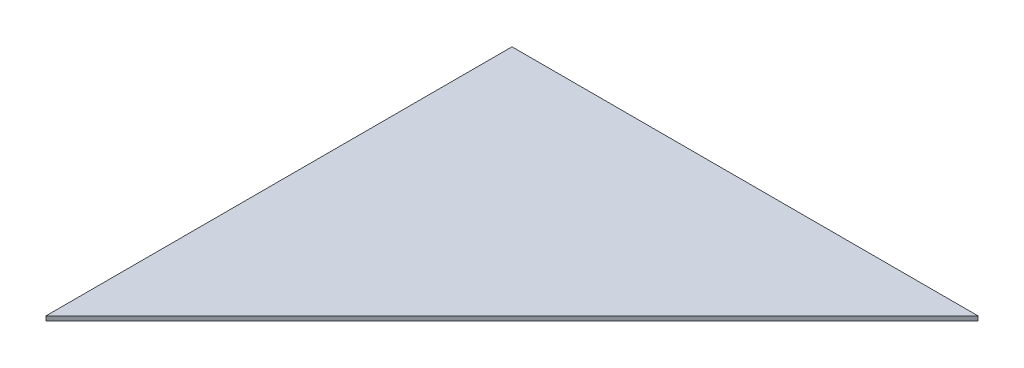
ISO-10303-21;
HEADER;
FILE_DESCRIPTION(('STEP AP214'),'2;1');
FILE_NAME('part.step','',(''),(''),'','','');
FILE_SCHEMA(('AUTOMOTIVE_DESIGN { 1 0 10303 214 1 1 1 1 }'));
ENDSEC;
DATA;
#1=APPLICATION_CONTEXT('core data for automotive mechanical design processes');
#2=APPLICATION_PROTOCOL_DEFINITION('international standard','automotive_design',2000,#1);
#3=PRODUCT_CONTEXT('',#1,'mechanical');
#4=PRODUCT('Part','Part','',(#3));
#5=PRODUCT_RELATED_PRODUCT_CATEGORY('part','',(#4));
#6=PRODUCT_DEFINITION_FORMATION('','',#4);
#7=PRODUCT_DEFINITION_CONTEXT('part definition',#1,'design');
#8=PRODUCT_DEFINITION('design','',#6,#7);
#9=PRODUCT_DEFINITION_SHAPE('','',#8);
#10=(LENGTH_UNIT() NAMED_UNIT(*) SI_UNIT(.MILLI.,.METRE.));
#11=(NAMED_UNIT(*) PLANE_ANGLE_UNIT() SI_UNIT($,.RADIAN.));
#12=(NAMED_UNIT(*) SI_UNIT($,.STERADIAN.) SOLID_ANGLE_UNIT());
#13=UNCERTAINTY_MEASURE_WITH_UNIT(LENGTH_MEASURE(1.E-05),#10,'distance_accuracy_value','');
#14=(GEOMETRIC_REPRESENTATION_CONTEXT(3) GLOBAL_UNCERTAINTY_ASSIGNED_CONTEXT((#13)) GLOBAL_UNIT_ASSIGNED_CONTEXT((#10,
#11,#12)) REPRESENTATION_CONTEXT('',''));
#15=CARTESIAN_POINT('',(0.,0.,0.));
#16=DIRECTION('',(0.,0.,1.));
#17=DIRECTION('',(1.,0.,0.));
#18=AXIS2_PLACEMENT_3D('',#15,#16,#17);
#19=CARTESIAN_POINT('',(-609.6,5.55625,-609.6));
#20=DIRECTION('',(0.,0.,1.));
#21=DIRECTION('',(1.,0.,0.));
#22=AXIS2_PLACEMENT_3D('',#19,#20,#21);
#23=PLANE('',#22);
#24=DIRECTION('',(0.,-1.,0.));
#25=VECTOR('',#24,1.);
#26=CARTESIAN_POINT('',(-52.8241204949789,5.55625,-609.6));
#27=LINE('',#26,#25);
#28=CARTESIAN_POINT('',(-52.8241204949789,5.55625,-609.6));
#29=VERTEX_POINT('',#28);
#30=CARTESIAN_POINT('',(-52.8241204949789,0.,-609.6));
#31=VERTEX_POINT('',#30);
#32=EDGE_CURVE('E80',#29,#31,#27,.T.);
#33=ORIENTED_EDGE('',*,*,#32,.T.);
#34=DIRECTION('',(-1.,0.,0.));
#35=VECTOR('',#34,1.);
#36=CARTESIAN_POINT('',(-609.6,0.,-609.6));
#37=LINE('',#36,#35);
#38=CARTESIAN_POINT('',(-609.6,0.,-609.6));
#39=VERTEX_POINT('',#38);
#40=EDGE_CURVE('E94',#31,#39,#37,.T.);
#41=ORIENTED_EDGE('',*,*,#40,.T.);
#42=DIRECTION('',(0.,-1.,0.));
#43=VECTOR('',#42,1.);
#44=CARTESIAN_POINT('',(-609.6,5.55625,-609.6));
#45=LINE('',#44,#43);
#46=CARTESIAN_POINT('',(-609.6,5.55625,-609.6));
#47=VERTEX_POINT('',#46);
#48=EDGE_CURVE('E11',#47,#39,#45,.T.);
#49=ORIENTED_EDGE('',*,*,#48,.F.);
#50=DIRECTION('',(-1.,0.,0.));
#51=VECTOR('',#50,1.);
#52=CARTESIAN_POINT('',(-609.6,5.55625,-609.6));
#53=LINE('',#52,#51);
#54=EDGE_CURVE('E69',#29,#47,#53,.T.);
#55=ORIENTED_EDGE('',*,*,#54,.F.);
#56=EDGE_LOOP('',(#33,#41,#49,#55));
#57=FACE_BOUND('',#56,.T.);
#58=ADVANCED_FACE('F46',(#57),#23,.F.);
#59=CARTESIAN_POINT('',(-609.6,5.55625,609.6));
#60=DIRECTION('',(1.,0.,0.));
#61=DIRECTION('',(0.,0.,-1.));
#62=AXIS2_PLACEMENT_3D('',#59,#60,#61);
#63=PLANE('',#62);
#64=DIRECTION('',(0.,-1.,0.));
#65=VECTOR('',#64,1.);
#66=CARTESIAN_POINT('',(-609.6,5.55625,-52.8241204949788));
#67=LINE('',#66,#65);
#68=CARTESIAN_POINT('',(-609.6,5.55625,-52.8241204949788));
#69=VERTEX_POINT('',#68);
#70=CARTESIAN_POINT('',(-609.6,0.,-52.8241204949786));
#71=VERTEX_POINT('',#70);
#72=EDGE_CURVE('E60',#69,#71,#67,.T.);
#73=ORIENTED_EDGE('',*,*,#72,.F.);
#74=DIRECTION('',(0.,0.,1.));
#75=VECTOR('',#74,1.);
#76=CARTESIAN_POINT('',(-609.6,5.55625,609.6));
#77=LINE('',#76,#75);
#78=EDGE_CURVE('E53',#47,#69,#77,.T.);
#79=ORIENTED_EDGE('',*,*,#78,.F.);
#80=ORIENTED_EDGE('',*,*,#48,.T.);
#81=DIRECTION('',(0.,0.,1.));
#82=VECTOR('',#81,1.);
#83=CARTESIAN_POINT('',(-609.6,0.,609.6));
#84=LINE('',#83,#82);
#85=EDGE_CURVE('E90',#39,#71,#84,.T.);
#86=ORIENTED_EDGE('',*,*,#85,.T.);
#87=EDGE_LOOP('',(#73,#79,#80,#86));
#88=FACE_BOUND('',#87,.T.);
#89=ADVANCED_FACE('F102',(#88),#63,.F.);
#90=CARTESIAN_POINT('',(0.,5.55625,0.));
#91=DIRECTION('',(0.,-1.,0.));
#92=DIRECTION('',(0.,0.,-1.));
#93=AXIS2_PLACEMENT_3D('',#90,#91,#92);
#94=PLANE('',#93);
#95=DIRECTION('',(-0.707106781186548,0.,0.707106781186547));
#96=VECTOR('',#95,1.);
#97=CARTESIAN_POINT('',(-331.212060247489,5.55625,-331.21206024749));
#98=LINE('',#97,#96);
#99=EDGE_CURVE('E82',#29,#69,#98,.T.);
#100=ORIENTED_EDGE('',*,*,#99,.F.);
#101=ORIENTED_EDGE('',*,*,#54,.T.);
#102=ORIENTED_EDGE('',*,*,#78,.T.);
#103=EDGE_LOOP('',(#100,#101,#102));
#104=FACE_BOUND('',#103,.T.);
#105=ADVANCED_FACE('F87',(#104),#94,.F.);
#106=CARTESIAN_POINT('',(0.,0.,0.));
#107=DIRECTION('',(0.,-1.,0.));
#108=DIRECTION('',(0.,0.,-1.));
#109=AXIS2_PLACEMENT_3D('',#106,#107,#108);
#110=PLANE('',#109);
#111=ORIENTED_EDGE('',*,*,#40,.F.);
#112=DIRECTION('',(-0.707106781186548,0.,0.707106781186547));
#113=VECTOR('',#112,1.);
#114=CARTESIAN_POINT('',(-331.212060247489,0.,-331.21206024749));
#115=LINE('',#114,#113);
#116=EDGE_CURVE('E83',#31,#71,#115,.T.);
#117=ORIENTED_EDGE('',*,*,#116,.T.);
#118=ORIENTED_EDGE('',*,*,#85,.F.);
#119=EDGE_LOOP('',(#111,#117,#118));
#120=FACE_BOUND('',#119,.T.);
#121=ADVANCED_FACE('F100',(#120),#110,.T.);
#122=CARTESIAN_POINT('',(-331.212060247489,5.55625,-331.21206024749));
#123=DIRECTION('',(0.707106781186547,0.,0.707106781186548));
#124=DIRECTION('',(0.707106781186548,0.,-0.707106781186547));
#125=AXIS2_PLACEMENT_3D('',#122,#123,#124);
#126=PLANE('',#125);
#127=ORIENTED_EDGE('',*,*,#116,.F.);
#128=ORIENTED_EDGE('',*,*,#32,.F.);
#129=ORIENTED_EDGE('',*,*,#99,.T.);
#130=ORIENTED_EDGE('',*,*,#72,.T.);
#131=EDGE_LOOP('',(#127,#128,#129,#130));
#132=FACE_BOUND('',#131,.T.);
#133=ADVANCED_FACE('F81',(#132),#126,.T.);
#134=CLOSED_SHELL('',(#58,#89,#105,#121,#133));
#135=MANIFOLD_SOLID_BREP('B2',#134);
#136=ADVANCED_BREP_SHAPE_REPRESENTATION('',(#18,#135),#14);
#137=SHAPE_DEFINITION_REPRESENTATION(#9,#136);
ENDSEC;
END-ISO-10303-21;
